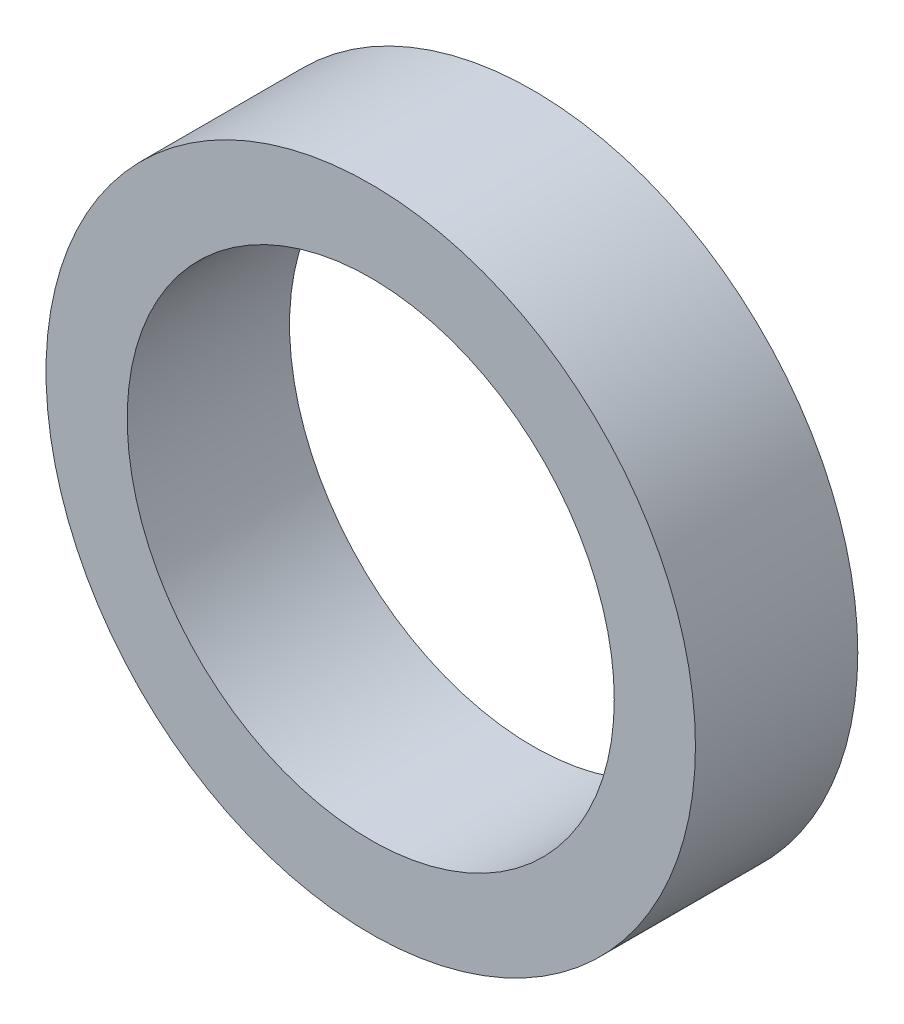
ISO-10303-21;
HEADER;
FILE_DESCRIPTION(('STEP AP214'),'2;1');
FILE_NAME('part.step','',(''),(''),'','','');
FILE_SCHEMA(('AUTOMOTIVE_DESIGN { 1 0 10303 214 1 1 1 1 }'));
ENDSEC;
DATA;
#1=APPLICATION_CONTEXT('core data for automotive mechanical design processes');
#2=APPLICATION_PROTOCOL_DEFINITION('international standard','automotive_design',2000,#1);
#3=PRODUCT_CONTEXT('',#1,'mechanical');
#4=PRODUCT('Part','Part','',(#3));
#5=PRODUCT_RELATED_PRODUCT_CATEGORY('part','',(#4));
#6=PRODUCT_DEFINITION_FORMATION('','',#4);
#7=PRODUCT_DEFINITION_CONTEXT('part definition',#1,'design');
#8=PRODUCT_DEFINITION('design','',#6,#7);
#9=PRODUCT_DEFINITION_SHAPE('','',#8);
#10=(LENGTH_UNIT() NAMED_UNIT(*) SI_UNIT(.MILLI.,.METRE.));
#11=(NAMED_UNIT(*) PLANE_ANGLE_UNIT() SI_UNIT($,.RADIAN.));
#12=(NAMED_UNIT(*) SI_UNIT($,.STERADIAN.) SOLID_ANGLE_UNIT());
#13=UNCERTAINTY_MEASURE_WITH_UNIT(LENGTH_MEASURE(1.E-05),#10,'distance_accuracy_value','');
#14=(GEOMETRIC_REPRESENTATION_CONTEXT(3) GLOBAL_UNCERTAINTY_ASSIGNED_CONTEXT((#13)) GLOBAL_UNIT_ASSIGNED_CONTEXT((#10,
#11,#12)) REPRESENTATION_CONTEXT('',''));
#15=CARTESIAN_POINT('',(0.,0.,0.));
#16=DIRECTION('',(0.,0.,1.));
#17=DIRECTION('',(1.,0.,0.));
#18=AXIS2_PLACEMENT_3D('',#15,#16,#17);
#19=CARTESIAN_POINT('',(0.,0.,4.));
#20=DIRECTION('',(0.,0.,1.));
#21=DIRECTION('',(1.,0.,0.));
#22=AXIS2_PLACEMENT_3D('',#19,#20,#21);
#23=PLANE('',#22);
#24=CARTESIAN_POINT('',(0.,0.,4.));
#25=DIRECTION('',(0.,0.,1.));
#26=DIRECTION('',(1.,0.,0.));
#27=AXIS2_PLACEMENT_3D('',#24,#25,#26);
#28=CIRCLE('',#27,8.);
#29=CARTESIAN_POINT('',(8.,0.,4.));
#30=VERTEX_POINT('',#29);
#31=EDGE_CURVE('E10',#30,#30,#28,.T.);
#32=ORIENTED_EDGE('',*,*,#31,.T.);
#33=EDGE_LOOP('',(#32));
#34=FACE_BOUND('',#33,.T.);
#35=CARTESIAN_POINT('',(0.,0.,4.));
#36=DIRECTION('',(0.,0.,1.));
#37=DIRECTION('',(1.,0.,0.));
#38=AXIS2_PLACEMENT_3D('',#35,#36,#37);
#39=CIRCLE('',#38,6.);
#40=CARTESIAN_POINT('',(6.,0.,4.));
#41=VERTEX_POINT('',#40);
#42=EDGE_CURVE('E42',#41,#41,#39,.T.);
#43=ORIENTED_EDGE('',*,*,#42,.F.);
#44=EDGE_LOOP('',(#43));
#45=FACE_BOUND('',#44,.T.);
#46=ADVANCED_FACE('F31',(#34,#45),#23,.T.);
#47=CARTESIAN_POINT('',(0.,0.,0.));
#48=DIRECTION('',(0.,0.,1.));
#49=DIRECTION('',(1.,0.,0.));
#50=AXIS2_PLACEMENT_3D('',#47,#48,#49);
#51=PLANE('',#50);
#52=CARTESIAN_POINT('',(0.,0.,0.));
#53=DIRECTION('',(0.,0.,1.));
#54=DIRECTION('',(1.,0.,0.));
#55=AXIS2_PLACEMENT_3D('',#52,#53,#54);
#56=CIRCLE('',#55,8.);
#57=CARTESIAN_POINT('',(8.,0.,0.));
#58=VERTEX_POINT('',#57);
#59=EDGE_CURVE('E35',#58,#58,#56,.T.);
#60=ORIENTED_EDGE('',*,*,#59,.F.);
#61=EDGE_LOOP('',(#60));
#62=FACE_BOUND('',#61,.T.);
#63=CARTESIAN_POINT('',(0.,0.,0.));
#64=DIRECTION('',(0.,0.,1.));
#65=DIRECTION('',(1.,0.,0.));
#66=AXIS2_PLACEMENT_3D('',#63,#64,#65);
#67=CIRCLE('',#66,6.);
#68=CARTESIAN_POINT('',(6.,0.,0.));
#69=VERTEX_POINT('',#68);
#70=EDGE_CURVE('E44',#69,#69,#67,.T.);
#71=ORIENTED_EDGE('',*,*,#70,.T.);
#72=EDGE_LOOP('',(#71));
#73=FACE_BOUND('',#72,.T.);
#74=ADVANCED_FACE('F54',(#62,#73),#51,.F.);
#75=CARTESIAN_POINT('',(0.,0.,4.));
#76=DIRECTION('',(0.,0.,-1.));
#77=DIRECTION('',(-1.,0.,0.));
#78=AXIS2_PLACEMENT_3D('',#75,#76,#77);
#79=CYLINDRICAL_SURFACE('',#78,8.);
#80=ORIENTED_EDGE('',*,*,#31,.F.);
#81=EDGE_LOOP('',(#80));
#82=FACE_BOUND('',#81,.T.);
#83=ORIENTED_EDGE('',*,*,#59,.T.);
#84=EDGE_LOOP('',(#83));
#85=FACE_BOUND('',#84,.T.);
#86=ADVANCED_FACE('F33',(#82,#85),#79,.T.);
#87=CARTESIAN_POINT('',(0.,0.,4.));
#88=DIRECTION('',(0.,0.,-1.));
#89=DIRECTION('',(-1.,0.,0.));
#90=AXIS2_PLACEMENT_3D('',#87,#88,#89);
#91=CYLINDRICAL_SURFACE('',#90,6.);
#92=ORIENTED_EDGE('',*,*,#42,.T.);
#93=EDGE_LOOP('',(#92));
#94=FACE_BOUND('',#93,.T.);
#95=ORIENTED_EDGE('',*,*,#70,.F.);
#96=EDGE_LOOP('',(#95));
#97=FACE_BOUND('',#96,.T.);
#98=ADVANCED_FACE('F50',(#94,#97),#91,.F.);
#99=CLOSED_SHELL('',(#46,#74,#86,#98));
#100=MANIFOLD_SOLID_BREP('B2',#99);
#101=ADVANCED_BREP_SHAPE_REPRESENTATION('',(#18,#100),#14);
#102=SHAPE_DEFINITION_REPRESENTATION(#9,#101);
ENDSEC;
END-ISO-10303-21;
